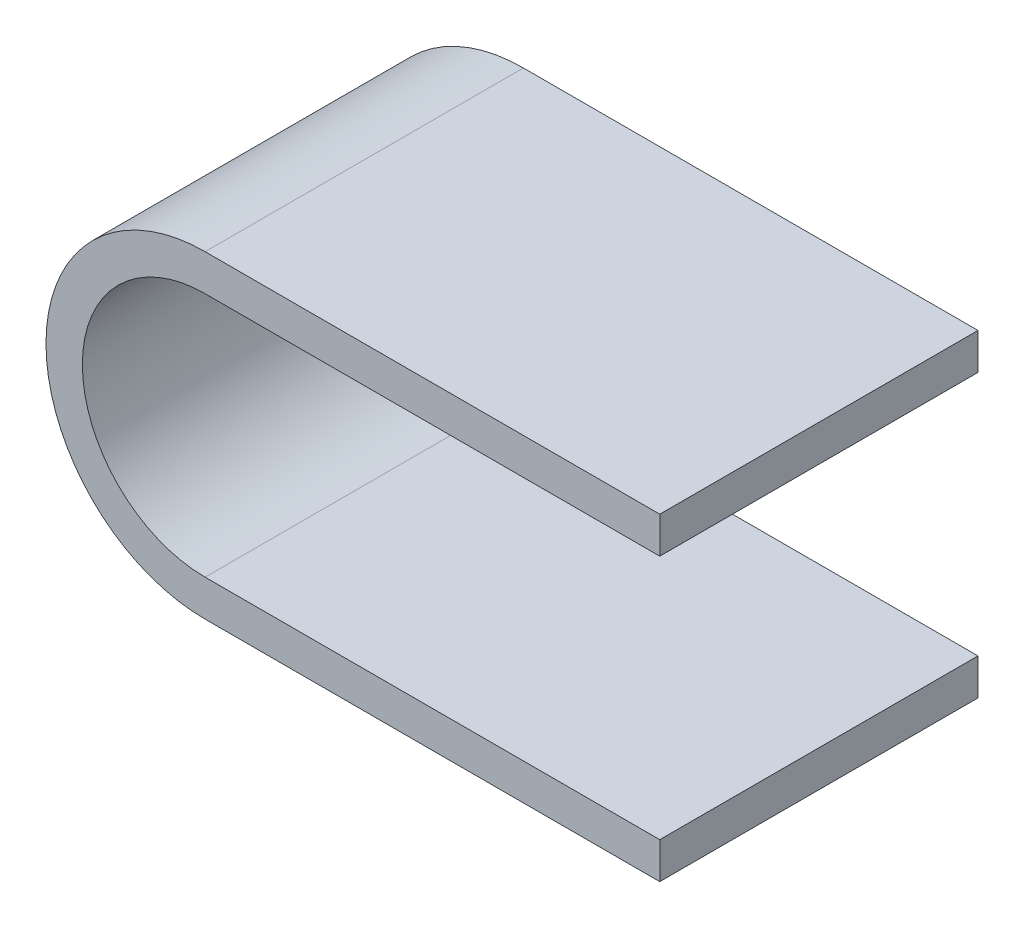
ISO-10303-21;
HEADER;
FILE_DESCRIPTION(('STEP AP214'),'2;1');
FILE_NAME('part.step','',(''),(''),'','','');
FILE_SCHEMA(('AUTOMOTIVE_DESIGN { 1 0 10303 214 1 1 1 1 }'));
ENDSEC;
DATA;
#1=APPLICATION_CONTEXT('core data for automotive mechanical design processes');
#2=APPLICATION_PROTOCOL_DEFINITION('international standard','automotive_design',2000,#1);
#3=PRODUCT_CONTEXT('',#1,'mechanical');
#4=PRODUCT('Part','Part','',(#3));
#5=PRODUCT_RELATED_PRODUCT_CATEGORY('part','',(#4));
#6=PRODUCT_DEFINITION_FORMATION('','',#4);
#7=PRODUCT_DEFINITION_CONTEXT('part definition',#1,'design');
#8=PRODUCT_DEFINITION('design','',#6,#7);
#9=PRODUCT_DEFINITION_SHAPE('','',#8);
#10=(LENGTH_UNIT() NAMED_UNIT(*) SI_UNIT(.MILLI.,.METRE.));
#11=(NAMED_UNIT(*) PLANE_ANGLE_UNIT() SI_UNIT($,.RADIAN.));
#12=(NAMED_UNIT(*) SI_UNIT($,.STERADIAN.) SOLID_ANGLE_UNIT());
#13=UNCERTAINTY_MEASURE_WITH_UNIT(LENGTH_MEASURE(1.E-05),#10,'distance_accuracy_value','');
#14=(GEOMETRIC_REPRESENTATION_CONTEXT(3) GLOBAL_UNCERTAINTY_ASSIGNED_CONTEXT((#13)) GLOBAL_UNIT_ASSIGNED_CONTEXT((#10,
#11,#12)) REPRESENTATION_CONTEXT('',''));
#15=CARTESIAN_POINT('',(0.,0.,0.));
#16=DIRECTION('',(0.,0.,1.));
#17=DIRECTION('',(1.,0.,0.));
#18=AXIS2_PLACEMENT_3D('',#15,#16,#17);
#19=CARTESIAN_POINT('',(0.,4.,35.));
#20=DIRECTION('',(-1.,0.,0.));
#21=DIRECTION('',(0.,-1.,0.));
#22=AXIS2_PLACEMENT_3D('',#19,#20,#21);
#23=PLANE('',#22);
#24=DIRECTION('',(0.,1.,0.));
#25=VECTOR('',#24,1.);
#26=CARTESIAN_POINT('',(0.,4.,0.));
#27=LINE('',#26,#25);
#28=CARTESIAN_POINT('',(0.,0.,0.));
#29=VERTEX_POINT('',#28);
#30=CARTESIAN_POINT('',(0.,4.,0.));
#31=VERTEX_POINT('',#30);
#32=EDGE_CURVE('E129',#29,#31,#27,.T.);
#33=ORIENTED_EDGE('',*,*,#32,.T.);
#34=DIRECTION('',(0.,0.,-1.));
#35=VECTOR('',#34,1.);
#36=CARTESIAN_POINT('',(0.,4.,35.));
#37=LINE('',#36,#35);
#38=CARTESIAN_POINT('',(0.,4.,35.));
#39=VERTEX_POINT('',#38);
#40=EDGE_CURVE('E11',#39,#31,#37,.T.);
#41=ORIENTED_EDGE('',*,*,#40,.F.);
#42=DIRECTION('',(0.,1.,0.));
#43=VECTOR('',#42,1.);
#44=CARTESIAN_POINT('',(0.,4.,35.));
#45=LINE('',#44,#43);
#46=CARTESIAN_POINT('',(0.,0.,35.));
#47=VERTEX_POINT('',#46);
#48=EDGE_CURVE('E143',#47,#39,#45,.T.);
#49=ORIENTED_EDGE('',*,*,#48,.F.);
#50=DIRECTION('',(0.,0.,-1.));
#51=VECTOR('',#50,1.);
#52=CARTESIAN_POINT('',(0.,0.,35.));
#53=LINE('',#52,#51);
#54=EDGE_CURVE('E125',#47,#29,#53,.T.);
#55=ORIENTED_EDGE('',*,*,#54,.T.);
#56=EDGE_LOOP('',(#33,#41,#49,#55));
#57=FACE_BOUND('',#56,.T.);
#58=ADVANCED_FACE('F33',(#57),#23,.F.);
#59=CARTESIAN_POINT('',(0.,4.,35.));
#60=DIRECTION('',(0.,-1.,0.));
#61=DIRECTION('',(1.,0.,0.));
#62=AXIS2_PLACEMENT_3D('',#59,#60,#61);
#63=PLANE('',#62);
#64=DIRECTION('',(-1.,0.,0.));
#65=VECTOR('',#64,1.);
#66=CARTESIAN_POINT('',(0.,4.,0.));
#67=LINE('',#66,#65);
#68=CARTESIAN_POINT('',(-50.,3.99999999999999,0.));
#69=VERTEX_POINT('',#68);
#70=EDGE_CURVE('E132',#31,#69,#67,.T.);
#71=ORIENTED_EDGE('',*,*,#70,.T.);
#72=DIRECTION('',(0.,0.,-1.));
#73=VECTOR('',#72,1.);
#74=CARTESIAN_POINT('',(-50.,3.99999999999999,35.));
#75=LINE('',#74,#73);
#76=CARTESIAN_POINT('',(-50.,3.99999999999999,35.));
#77=VERTEX_POINT('',#76);
#78=EDGE_CURVE('E41',#77,#69,#75,.T.);
#79=ORIENTED_EDGE('',*,*,#78,.F.);
#80=DIRECTION('',(-1.,0.,0.));
#81=VECTOR('',#80,1.);
#82=CARTESIAN_POINT('',(0.,4.,35.));
#83=LINE('',#82,#81);
#84=EDGE_CURVE('E92',#39,#77,#83,.T.);
#85=ORIENTED_EDGE('',*,*,#84,.F.);
#86=ORIENTED_EDGE('',*,*,#40,.T.);
#87=EDGE_LOOP('',(#71,#79,#85,#86));
#88=FACE_BOUND('',#87,.T.);
#89=ADVANCED_FACE('F178',(#88),#63,.F.);
#90=CARTESIAN_POINT('',(-50.,17.5,35.));
#91=DIRECTION('',(0.,0.,-1.));
#92=DIRECTION('',(-1.,0.,0.));
#93=AXIS2_PLACEMENT_3D('',#90,#91,#92);
#94=CYLINDRICAL_SURFACE('',#93,13.5);
#95=CARTESIAN_POINT('',(-50.,17.5,0.));
#96=DIRECTION('',(0.,0.,-1.));
#97=DIRECTION('',(-1.,0.,0.));
#98=AXIS2_PLACEMENT_3D('',#95,#96,#97);
#99=CIRCLE('',#98,13.5);
#100=CARTESIAN_POINT('',(-50.,31.,0.));
#101=VERTEX_POINT('',#100);
#102=EDGE_CURVE('E134',#69,#101,#99,.T.);
#103=ORIENTED_EDGE('',*,*,#102,.T.);
#104=DIRECTION('',(0.,0.,-1.));
#105=VECTOR('',#104,1.);
#106=CARTESIAN_POINT('',(-50.,31.,35.));
#107=LINE('',#106,#105);
#108=CARTESIAN_POINT('',(-50.,31.,35.));
#109=VERTEX_POINT('',#108);
#110=EDGE_CURVE('E150',#109,#101,#107,.T.);
#111=ORIENTED_EDGE('',*,*,#110,.F.);
#112=CARTESIAN_POINT('',(-50.,17.5,35.));
#113=DIRECTION('',(0.,0.,-1.));
#114=DIRECTION('',(-1.,0.,0.));
#115=AXIS2_PLACEMENT_3D('',#112,#113,#114);
#116=CIRCLE('',#115,13.5);
#117=EDGE_CURVE('E158',#77,#109,#116,.T.);
#118=ORIENTED_EDGE('',*,*,#117,.F.);
#119=ORIENTED_EDGE('',*,*,#78,.T.);
#120=EDGE_LOOP('',(#103,#111,#118,#119));
#121=FACE_BOUND('',#120,.T.);
#122=ADVANCED_FACE('F156',(#121),#94,.F.);
#123=CARTESIAN_POINT('',(-50.,31.,35.));
#124=DIRECTION('',(0.,1.,0.));
#125=DIRECTION('',(0.,0.,1.));
#126=AXIS2_PLACEMENT_3D('',#123,#124,#125);
#127=PLANE('',#126);
#128=DIRECTION('',(1.,0.,0.));
#129=VECTOR('',#128,1.);
#130=CARTESIAN_POINT('',(-50.,31.,0.));
#131=LINE('',#130,#129);
#132=CARTESIAN_POINT('',(0.,31.,0.));
#133=VERTEX_POINT('',#132);
#134=EDGE_CURVE('E136',#101,#133,#131,.T.);
#135=ORIENTED_EDGE('',*,*,#134,.T.);
#136=DIRECTION('',(0.,0.,-1.));
#137=VECTOR('',#136,1.);
#138=CARTESIAN_POINT('',(0.,31.,35.));
#139=LINE('',#138,#137);
#140=CARTESIAN_POINT('',(0.,31.,35.));
#141=VERTEX_POINT('',#140);
#142=EDGE_CURVE('E147',#141,#133,#139,.T.);
#143=ORIENTED_EDGE('',*,*,#142,.F.);
#144=DIRECTION('',(1.,0.,0.));
#145=VECTOR('',#144,1.);
#146=CARTESIAN_POINT('',(-50.,31.,35.));
#147=LINE('',#146,#145);
#148=EDGE_CURVE('E170',#109,#141,#147,.T.);
#149=ORIENTED_EDGE('',*,*,#148,.F.);
#150=ORIENTED_EDGE('',*,*,#110,.T.);
#151=EDGE_LOOP('',(#135,#143,#149,#150));
#152=FACE_BOUND('',#151,.T.);
#153=ADVANCED_FACE('F166',(#152),#127,.F.);
#154=CARTESIAN_POINT('',(0.,35.,35.));
#155=DIRECTION('',(-1.,0.,0.));
#156=DIRECTION('',(0.,0.,1.));
#157=AXIS2_PLACEMENT_3D('',#154,#155,#156);
#158=PLANE('',#157);
#159=DIRECTION('',(0.,1.,0.));
#160=VECTOR('',#159,1.);
#161=CARTESIAN_POINT('',(0.,35.,0.));
#162=LINE('',#161,#160);
#163=CARTESIAN_POINT('',(0.,35.,0.));
#164=VERTEX_POINT('',#163);
#165=EDGE_CURVE('E138',#133,#164,#162,.T.);
#166=ORIENTED_EDGE('',*,*,#165,.T.);
#167=DIRECTION('',(0.,0.,-1.));
#168=VECTOR('',#167,1.);
#169=CARTESIAN_POINT('',(0.,35.,35.));
#170=LINE('',#169,#168);
#171=CARTESIAN_POINT('',(0.,35.,35.));
#172=VERTEX_POINT('',#171);
#173=EDGE_CURVE('E120',#172,#164,#170,.T.);
#174=ORIENTED_EDGE('',*,*,#173,.F.);
#175=DIRECTION('',(0.,1.,0.));
#176=VECTOR('',#175,1.);
#177=CARTESIAN_POINT('',(0.,35.,35.));
#178=LINE('',#177,#176);
#179=EDGE_CURVE('E111',#141,#172,#178,.T.);
#180=ORIENTED_EDGE('',*,*,#179,.F.);
#181=ORIENTED_EDGE('',*,*,#142,.T.);
#182=EDGE_LOOP('',(#166,#174,#180,#181));
#183=FACE_BOUND('',#182,.T.);
#184=ADVANCED_FACE('F169',(#183),#158,.F.);
#185=CARTESIAN_POINT('',(-50.,35.,35.));
#186=DIRECTION('',(0.,-1.,0.));
#187=DIRECTION('',(0.,0.,-1.));
#188=AXIS2_PLACEMENT_3D('',#185,#186,#187);
#189=PLANE('',#188);
#190=DIRECTION('',(-1.,0.,0.));
#191=VECTOR('',#190,1.);
#192=CARTESIAN_POINT('',(-50.,35.,0.));
#193=LINE('',#192,#191);
#194=CARTESIAN_POINT('',(-50.,35.,0.));
#195=VERTEX_POINT('',#194);
#196=EDGE_CURVE('E119',#164,#195,#193,.T.);
#197=ORIENTED_EDGE('',*,*,#196,.T.);
#198=DIRECTION('',(0.,0.,-1.));
#199=VECTOR('',#198,1.);
#200=CARTESIAN_POINT('',(-50.,35.,35.));
#201=LINE('',#200,#199);
#202=CARTESIAN_POINT('',(-50.,35.,35.));
#203=VERTEX_POINT('',#202);
#204=EDGE_CURVE('E116',#203,#195,#201,.T.);
#205=ORIENTED_EDGE('',*,*,#204,.F.);
#206=DIRECTION('',(-1.,0.,0.));
#207=VECTOR('',#206,1.);
#208=CARTESIAN_POINT('',(-50.,35.,35.));
#209=LINE('',#208,#207);
#210=EDGE_CURVE('E105',#172,#203,#209,.T.);
#211=ORIENTED_EDGE('',*,*,#210,.F.);
#212=ORIENTED_EDGE('',*,*,#173,.T.);
#213=EDGE_LOOP('',(#197,#205,#211,#212));
#214=FACE_BOUND('',#213,.T.);
#215=ADVANCED_FACE('F117',(#214),#189,.F.);
#216=CARTESIAN_POINT('',(-50.,17.5,35.));
#217=DIRECTION('',(0.,0.,-1.));
#218=DIRECTION('',(-1.,0.,0.));
#219=AXIS2_PLACEMENT_3D('',#216,#217,#218);
#220=CYLINDRICAL_SURFACE('',#219,17.5);
#221=CARTESIAN_POINT('',(-50.,17.5,0.));
#222=DIRECTION('',(0.,0.,1.));
#223=DIRECTION('',(-1.,0.,0.));
#224=AXIS2_PLACEMENT_3D('',#221,#222,#223);
#225=CIRCLE('',#224,17.5);
#226=CARTESIAN_POINT('',(-50.,0.,0.));
#227=VERTEX_POINT('',#226);
#228=EDGE_CURVE('E78',#195,#227,#225,.T.);
#229=ORIENTED_EDGE('',*,*,#228,.T.);
#230=DIRECTION('',(0.,0.,-1.));
#231=VECTOR('',#230,1.);
#232=CARTESIAN_POINT('',(-50.,0.,35.));
#233=LINE('',#232,#231);
#234=CARTESIAN_POINT('',(-50.,0.,35.));
#235=VERTEX_POINT('',#234);
#236=EDGE_CURVE('E121',#235,#227,#233,.T.);
#237=ORIENTED_EDGE('',*,*,#236,.F.);
#238=CARTESIAN_POINT('',(-50.,17.5,35.));
#239=DIRECTION('',(0.,0.,1.));
#240=DIRECTION('',(-1.,0.,0.));
#241=AXIS2_PLACEMENT_3D('',#238,#239,#240);
#242=CIRCLE('',#241,17.5);
#243=EDGE_CURVE('E109',#203,#235,#242,.T.);
#244=ORIENTED_EDGE('',*,*,#243,.F.);
#245=ORIENTED_EDGE('',*,*,#204,.T.);
#246=EDGE_LOOP('',(#229,#237,#244,#245));
#247=FACE_BOUND('',#246,.T.);
#248=ADVANCED_FACE('F123',(#247),#220,.T.);
#249=CARTESIAN_POINT('',(0.,0.,35.));
#250=DIRECTION('',(0.,1.,0.));
#251=DIRECTION('',(-1.,0.,0.));
#252=AXIS2_PLACEMENT_3D('',#249,#250,#251);
#253=PLANE('',#252);
#254=DIRECTION('',(1.,0.,0.));
#255=VECTOR('',#254,1.);
#256=CARTESIAN_POINT('',(0.,0.,0.));
#257=LINE('',#256,#255);
#258=EDGE_CURVE('E84',#227,#29,#257,.T.);
#259=ORIENTED_EDGE('',*,*,#258,.T.);
#260=ORIENTED_EDGE('',*,*,#54,.F.);
#261=DIRECTION('',(1.,0.,0.));
#262=VECTOR('',#261,1.);
#263=CARTESIAN_POINT('',(0.,0.,35.));
#264=LINE('',#263,#262);
#265=EDGE_CURVE('E49',#235,#47,#264,.T.);
#266=ORIENTED_EDGE('',*,*,#265,.F.);
#267=ORIENTED_EDGE('',*,*,#236,.T.);
#268=EDGE_LOOP('',(#259,#260,#266,#267));
#269=FACE_BOUND('',#268,.T.);
#270=ADVANCED_FACE('F194',(#269),#253,.F.);
#271=CARTESIAN_POINT('',(-50.,17.5,35.));
#272=DIRECTION('',(0.,0.,-1.));
#273=DIRECTION('',(-1.,0.,0.));
#274=AXIS2_PLACEMENT_3D('',#271,#272,#273);
#275=PLANE('',#274);
#276=ORIENTED_EDGE('',*,*,#48,.T.);
#277=ORIENTED_EDGE('',*,*,#84,.T.);
#278=ORIENTED_EDGE('',*,*,#117,.T.);
#279=ORIENTED_EDGE('',*,*,#148,.T.);
#280=ORIENTED_EDGE('',*,*,#179,.T.);
#281=ORIENTED_EDGE('',*,*,#210,.T.);
#282=ORIENTED_EDGE('',*,*,#243,.T.);
#283=ORIENTED_EDGE('',*,*,#265,.T.);
#284=EDGE_LOOP('',(#276,#277,#278,#279,#280,#281,#282,#283));
#285=FACE_BOUND('',#284,.T.);
#286=ADVANCED_FACE('F107',(#285),#275,.F.);
#287=CARTESIAN_POINT('',(-50.,17.5,0.));
#288=DIRECTION('',(0.,0.,-1.));
#289=DIRECTION('',(-1.,0.,0.));
#290=AXIS2_PLACEMENT_3D('',#287,#288,#289);
#291=PLANE('',#290);
#292=ORIENTED_EDGE('',*,*,#32,.F.);
#293=ORIENTED_EDGE('',*,*,#258,.F.);
#294=ORIENTED_EDGE('',*,*,#228,.F.);
#295=ORIENTED_EDGE('',*,*,#196,.F.);
#296=ORIENTED_EDGE('',*,*,#165,.F.);
#297=ORIENTED_EDGE('',*,*,#134,.F.);
#298=ORIENTED_EDGE('',*,*,#102,.F.);
#299=ORIENTED_EDGE('',*,*,#70,.F.);
#300=EDGE_LOOP('',(#292,#293,#294,#295,#296,#297,#298,#299));
#301=FACE_BOUND('',#300,.T.);
#302=ADVANCED_FACE('F162',(#301),#291,.T.);
#303=CLOSED_SHELL('',(#58,#89,#122,#153,#184,#215,#248,#270,#286,#302));
#304=MANIFOLD_SOLID_BREP('B2',#303);
#305=ADVANCED_BREP_SHAPE_REPRESENTATION('',(#18,#304),#14);
#306=SHAPE_DEFINITION_REPRESENTATION(#9,#305);
ENDSEC;
END-ISO-10303-21;
